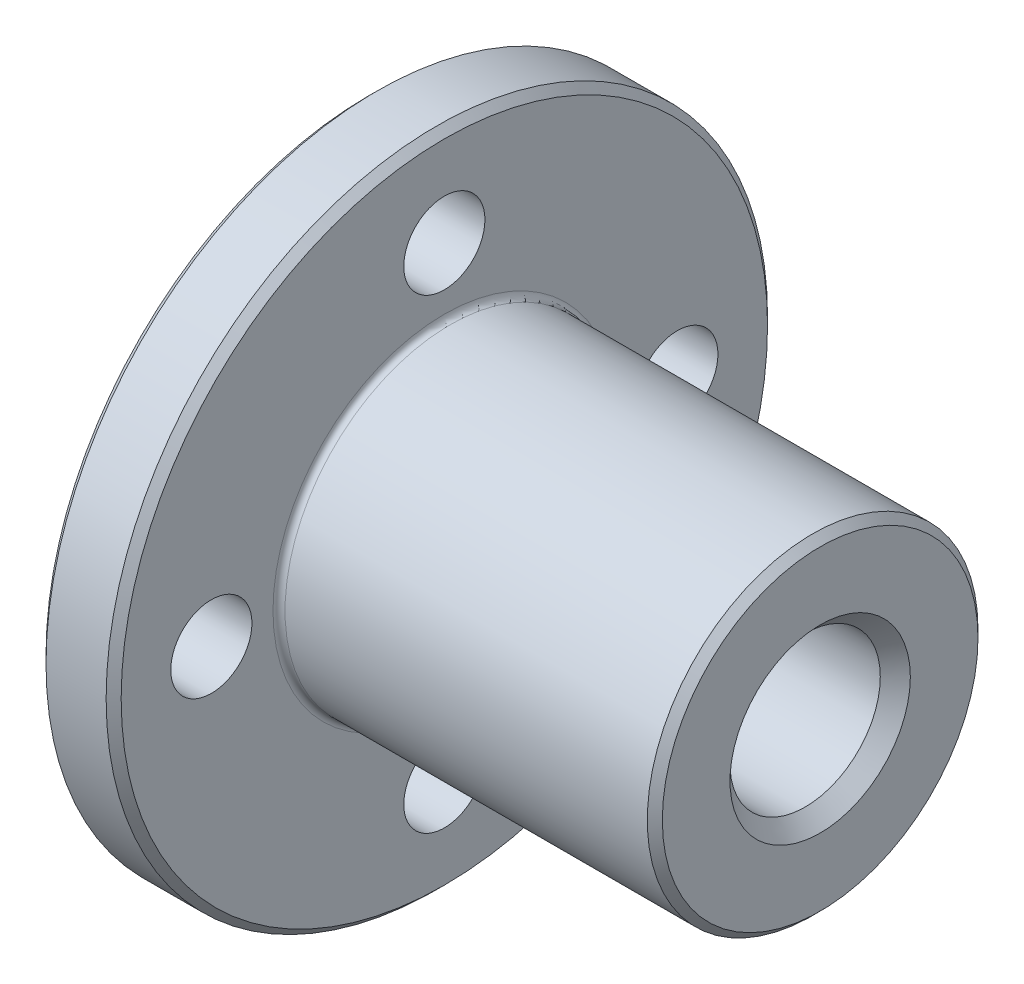
ISO-10303-21;
HEADER;
FILE_DESCRIPTION(('STEP AP214'),'2;1');
FILE_NAME('part.step','',(''),(''),'','','');
FILE_SCHEMA(('AUTOMOTIVE_DESIGN { 1 0 10303 214 1 1 1 1 }'));
ENDSEC;
DATA;
#1=APPLICATION_CONTEXT('core data for automotive mechanical design processes');
#2=APPLICATION_PROTOCOL_DEFINITION('international standard','automotive_design',2000,#1);
#3=PRODUCT_CONTEXT('',#1,'mechanical');
#4=PRODUCT('Part','Part','',(#3));
#5=PRODUCT_RELATED_PRODUCT_CATEGORY('part','',(#4));
#6=PRODUCT_DEFINITION_FORMATION('','',#4);
#7=PRODUCT_DEFINITION_CONTEXT('part definition',#1,'design');
#8=PRODUCT_DEFINITION('design','',#6,#7);
#9=PRODUCT_DEFINITION_SHAPE('','',#8);
#10=(LENGTH_UNIT() NAMED_UNIT(*) SI_UNIT(.MILLI.,.METRE.));
#11=(NAMED_UNIT(*) PLANE_ANGLE_UNIT() SI_UNIT($,.RADIAN.));
#12=(NAMED_UNIT(*) SI_UNIT($,.STERADIAN.) SOLID_ANGLE_UNIT());
#13=UNCERTAINTY_MEASURE_WITH_UNIT(LENGTH_MEASURE(1.E-05),#10,'distance_accuracy_value','');
#14=(GEOMETRIC_REPRESENTATION_CONTEXT(3) GLOBAL_UNCERTAINTY_ASSIGNED_CONTEXT((#13)) GLOBAL_UNIT_ASSIGNED_CONTEXT((#10,
#11,#12)) REPRESENTATION_CONTEXT('',''));
#15=CARTESIAN_POINT('',(0.,0.,0.));
#16=DIRECTION('',(0.,0.,1.));
#17=DIRECTION('',(1.,0.,0.));
#18=AXIS2_PLACEMENT_3D('',#15,#16,#17);
#19=CARTESIAN_POINT('',(5.,0.,0.));
#20=DIRECTION('',(-1.,0.,0.));
#21=DIRECTION('',(0.,0.,1.));
#22=AXIS2_PLACEMENT_3D('',#19,#20,#21);
#23=CYLINDRICAL_SURFACE('',#22,22.);
#24=CARTESIAN_POINT('',(0.500000000000025,0.,0.));
#25=DIRECTION('',(-1.,0.,0.));
#26=DIRECTION('',(0.,0.,1.));
#27=AXIS2_PLACEMENT_3D('',#24,#25,#26);
#28=CIRCLE('',#27,22.);
#29=CARTESIAN_POINT('',(0.500000000000025,0.,22.));
#30=VERTEX_POINT('',#29);
#31=EDGE_CURVE('E66',#30,#30,#28,.F.);
#32=ORIENTED_EDGE('',*,*,#31,.T.);
#33=EDGE_LOOP('',(#32));
#34=FACE_BOUND('',#33,.T.);
#35=CARTESIAN_POINT('',(4.49999999999999,0.,0.));
#36=DIRECTION('',(1.,0.,0.));
#37=DIRECTION('',(0.,0.,-1.));
#38=AXIS2_PLACEMENT_3D('',#35,#36,#37);
#39=CIRCLE('',#38,22.);
#40=CARTESIAN_POINT('',(4.49999999999999,0.,-22.));
#41=VERTEX_POINT('',#40);
#42=EDGE_CURVE('E69',#41,#41,#39,.F.);
#43=ORIENTED_EDGE('',*,*,#42,.T.);
#44=EDGE_LOOP('',(#43));
#45=FACE_BOUND('',#44,.T.);
#46=ADVANCED_FACE('F31',(#34,#45),#23,.T.);
#47=CARTESIAN_POINT('',(5.,22.,0.));
#48=DIRECTION('',(1.,0.,0.));
#49=DIRECTION('',(0.,0.,-1.));
#50=AXIS2_PLACEMENT_3D('',#47,#48,#49);
#51=PLANE('',#50);
#52=CARTESIAN_POINT('',(5.,0.,0.));
#53=DIRECTION('',(1.,0.,0.));
#54=DIRECTION('',(0.,0.,-1.));
#55=AXIS2_PLACEMENT_3D('',#52,#53,#54);
#56=CIRCLE('',#55,11.4);
#57=CARTESIAN_POINT('',(5.,0.,-11.4));
#58=VERTEX_POINT('',#57);
#59=EDGE_CURVE('E10',#58,#58,#56,.F.);
#60=ORIENTED_EDGE('',*,*,#59,.T.);
#61=EDGE_LOOP('',(#60));
#62=FACE_BOUND('',#61,.T.);
#63=CARTESIAN_POINT('',(5.,0.,0.));
#64=DIRECTION('',(1.,0.,0.));
#65=DIRECTION('',(0.,0.,-1.));
#66=AXIS2_PLACEMENT_3D('',#63,#64,#65);
#67=CIRCLE('',#66,21.5);
#68=CARTESIAN_POINT('',(5.,0.,-21.5));
#69=VERTEX_POINT('',#68);
#70=EDGE_CURVE('E57',#69,#69,#67,.T.);
#71=ORIENTED_EDGE('',*,*,#70,.T.);
#72=EDGE_LOOP('',(#71));
#73=FACE_BOUND('',#72,.T.);
#74=CARTESIAN_POINT('',(5.,-15.5,0.));
#75=DIRECTION('',(1.,0.,0.));
#76=DIRECTION('',(0.,0.,-1.));
#77=AXIS2_PLACEMENT_3D('',#74,#75,#76);
#78=CIRCLE('',#77,2.69999999999999);
#79=CARTESIAN_POINT('',(5.,-15.5,-2.69999999999999));
#80=VERTEX_POINT('',#79);
#81=EDGE_CURVE('E96',#80,#80,#78,.T.);
#82=ORIENTED_EDGE('',*,*,#81,.F.);
#83=EDGE_LOOP('',(#82));
#84=FACE_BOUND('',#83,.T.);
#85=CARTESIAN_POINT('',(5.,0.,-15.5));
#86=DIRECTION('',(1.,0.,0.));
#87=DIRECTION('',(0.,0.,-1.));
#88=AXIS2_PLACEMENT_3D('',#85,#86,#87);
#89=CIRCLE('',#88,2.69999999999999);
#90=CARTESIAN_POINT('',(5.,0.,-18.2));
#91=VERTEX_POINT('',#90);
#92=EDGE_CURVE('E90',#91,#91,#89,.T.);
#93=ORIENTED_EDGE('',*,*,#92,.F.);
#94=EDGE_LOOP('',(#93));
#95=FACE_BOUND('',#94,.T.);
#96=CARTESIAN_POINT('',(5.,0.,15.5));
#97=DIRECTION('',(1.,0.,0.));
#98=DIRECTION('',(0.,0.,-1.));
#99=AXIS2_PLACEMENT_3D('',#96,#97,#98);
#100=CIRCLE('',#99,2.69999999999999);
#101=CARTESIAN_POINT('',(5.,0.,12.8));
#102=VERTEX_POINT('',#101);
#103=EDGE_CURVE('E84',#102,#102,#100,.T.);
#104=ORIENTED_EDGE('',*,*,#103,.F.);
#105=EDGE_LOOP('',(#104));
#106=FACE_BOUND('',#105,.T.);
#107=CARTESIAN_POINT('',(5.,15.5,0.));
#108=DIRECTION('',(1.,0.,0.));
#109=DIRECTION('',(0.,0.,-1.));
#110=AXIS2_PLACEMENT_3D('',#107,#108,#109);
#111=CIRCLE('',#110,2.69999999999999);
#112=CARTESIAN_POINT('',(5.,15.5,-2.69999999999999));
#113=VERTEX_POINT('',#112);
#114=EDGE_CURVE('E78',#113,#113,#111,.T.);
#115=ORIENTED_EDGE('',*,*,#114,.F.);
#116=EDGE_LOOP('',(#115));
#117=FACE_BOUND('',#116,.T.);
#118=ADVANCED_FACE('F102',(#62,#73,#84,#95,#106,#117),#51,.T.);
#119=CARTESIAN_POINT('',(0.,0.,0.));
#120=DIRECTION('',(-1.,0.,0.));
#121=DIRECTION('',(0.,0.,1.));
#122=AXIS2_PLACEMENT_3D('',#119,#120,#121);
#123=PLANE('',#122);
#124=CARTESIAN_POINT('',(0.,0.,0.));
#125=DIRECTION('',(-1.,0.,0.));
#126=DIRECTION('',(0.,0.,1.));
#127=AXIS2_PLACEMENT_3D('',#124,#125,#126);
#128=CIRCLE('',#127,5.99999999999997);
#129=CARTESIAN_POINT('',(0.,0.,5.99999999999997));
#130=VERTEX_POINT('',#129);
#131=EDGE_CURVE('E54',#130,#130,#128,.F.);
#132=ORIENTED_EDGE('',*,*,#131,.T.);
#133=EDGE_LOOP('',(#132));
#134=FACE_BOUND('',#133,.T.);
#135=CARTESIAN_POINT('',(0.,0.,0.));
#136=DIRECTION('',(-1.,0.,0.));
#137=DIRECTION('',(0.,0.,1.));
#138=AXIS2_PLACEMENT_3D('',#135,#136,#137);
#139=CIRCLE('',#138,21.5);
#140=CARTESIAN_POINT('',(0.,0.,21.5));
#141=VERTEX_POINT('',#140);
#142=EDGE_CURVE('E72',#141,#141,#139,.T.);
#143=ORIENTED_EDGE('',*,*,#142,.T.);
#144=EDGE_LOOP('',(#143));
#145=FACE_BOUND('',#144,.T.);
#146=CARTESIAN_POINT('',(0.,-15.5,0.));
#147=DIRECTION('',(1.,0.,0.));
#148=DIRECTION('',(0.,0.,-1.));
#149=AXIS2_PLACEMENT_3D('',#146,#147,#148);
#150=CIRCLE('',#149,2.69999999999999);
#151=CARTESIAN_POINT('',(0.,-15.5,-2.69999999999999));
#152=VERTEX_POINT('',#151);
#153=EDGE_CURVE('E93',#152,#152,#150,.T.);
#154=ORIENTED_EDGE('',*,*,#153,.T.);
#155=EDGE_LOOP('',(#154));
#156=FACE_BOUND('',#155,.T.);
#157=CARTESIAN_POINT('',(0.,0.,-15.5));
#158=DIRECTION('',(1.,0.,0.));
#159=DIRECTION('',(0.,0.,-1.));
#160=AXIS2_PLACEMENT_3D('',#157,#158,#159);
#161=CIRCLE('',#160,2.69999999999999);
#162=CARTESIAN_POINT('',(0.,0.,-18.2));
#163=VERTEX_POINT('',#162);
#164=EDGE_CURVE('E87',#163,#163,#161,.T.);
#165=ORIENTED_EDGE('',*,*,#164,.T.);
#166=EDGE_LOOP('',(#165));
#167=FACE_BOUND('',#166,.T.);
#168=CARTESIAN_POINT('',(0.,0.,15.5));
#169=DIRECTION('',(1.,0.,0.));
#170=DIRECTION('',(0.,0.,-1.));
#171=AXIS2_PLACEMENT_3D('',#168,#169,#170);
#172=CIRCLE('',#171,2.69999999999999);
#173=CARTESIAN_POINT('',(0.,0.,12.8));
#174=VERTEX_POINT('',#173);
#175=EDGE_CURVE('E81',#174,#174,#172,.T.);
#176=ORIENTED_EDGE('',*,*,#175,.T.);
#177=EDGE_LOOP('',(#176));
#178=FACE_BOUND('',#177,.T.);
#179=CARTESIAN_POINT('',(0.,15.5,0.));
#180=DIRECTION('',(1.,0.,0.));
#181=DIRECTION('',(0.,0.,-1.));
#182=AXIS2_PLACEMENT_3D('',#179,#180,#181);
#183=CIRCLE('',#182,2.69999999999999);
#184=CARTESIAN_POINT('',(0.,15.5,-2.69999999999999));
#185=VERTEX_POINT('',#184);
#186=EDGE_CURVE('E75',#185,#185,#183,.T.);
#187=ORIENTED_EDGE('',*,*,#186,.T.);
#188=EDGE_LOOP('',(#187));
#189=FACE_BOUND('',#188,.T.);
#190=ADVANCED_FACE('F105',(#134,#145,#156,#167,#178,#189),#123,.T.);
#191=CARTESIAN_POINT('',(30.,0.,0.));
#192=DIRECTION('',(-1.,0.,0.));
#193=DIRECTION('',(0.,0.,1.));
#194=AXIS2_PLACEMENT_3D('',#191,#192,#193);
#195=CYLINDRICAL_SURFACE('',#194,11.);
#196=CARTESIAN_POINT('',(5.4,0.,0.));
#197=DIRECTION('',(1.,0.,0.));
#198=DIRECTION('',(0.,0.,-1.));
#199=AXIS2_PLACEMENT_3D('',#196,#197,#198);
#200=CIRCLE('',#199,11.);
#201=CARTESIAN_POINT('',(5.4,0.,-11.));
#202=VERTEX_POINT('',#201);
#203=EDGE_CURVE('E38',#202,#202,#200,.T.);
#204=ORIENTED_EDGE('',*,*,#203,.T.);
#205=EDGE_LOOP('',(#204));
#206=FACE_BOUND('',#205,.T.);
#207=CARTESIAN_POINT('',(29.5,0.,0.));
#208=DIRECTION('',(1.,0.,0.));
#209=DIRECTION('',(0.,0.,-1.));
#210=AXIS2_PLACEMENT_3D('',#207,#208,#209);
#211=CIRCLE('',#210,11.);
#212=CARTESIAN_POINT('',(29.5,0.,-11.));
#213=VERTEX_POINT('',#212);
#214=EDGE_CURVE('E60',#213,#213,#211,.F.);
#215=ORIENTED_EDGE('',*,*,#214,.T.);
#216=EDGE_LOOP('',(#215));
#217=FACE_BOUND('',#216,.T.);
#218=ADVANCED_FACE('F126',(#206,#217),#195,.T.);
#219=CARTESIAN_POINT('',(30.,0.,0.));
#220=DIRECTION('',(1.,0.,0.));
#221=DIRECTION('',(0.,0.,-1.));
#222=AXIS2_PLACEMENT_3D('',#219,#220,#221);
#223=PLANE('',#222);
#224=CARTESIAN_POINT('',(30.,0.,0.));
#225=DIRECTION('',(1.,0.,0.));
#226=DIRECTION('',(0.,0.,-1.));
#227=AXIS2_PLACEMENT_3D('',#224,#225,#226);
#228=CIRCLE('',#227,5.99999999999995);
#229=CARTESIAN_POINT('',(30.,0.,-5.99999999999995));
#230=VERTEX_POINT('',#229);
#231=EDGE_CURVE('E42',#230,#230,#228,.F.);
#232=ORIENTED_EDGE('',*,*,#231,.T.);
#233=EDGE_LOOP('',(#232));
#234=FACE_BOUND('',#233,.T.);
#235=CARTESIAN_POINT('',(30.,0.,0.));
#236=DIRECTION('',(1.,0.,0.));
#237=DIRECTION('',(0.,0.,-1.));
#238=AXIS2_PLACEMENT_3D('',#235,#236,#237);
#239=CIRCLE('',#238,10.5);
#240=CARTESIAN_POINT('',(30.,0.,-10.5));
#241=VERTEX_POINT('',#240);
#242=EDGE_CURVE('E63',#241,#241,#239,.T.);
#243=ORIENTED_EDGE('',*,*,#242,.T.);
#244=EDGE_LOOP('',(#243));
#245=FACE_BOUND('',#244,.T.);
#246=ADVANCED_FACE('F116',(#234,#245),#223,.T.);
#247=CARTESIAN_POINT('',(5.,15.5,0.));
#248=DIRECTION('',(1.,0.,0.));
#249=DIRECTION('',(0.,0.,-1.));
#250=AXIS2_PLACEMENT_3D('',#247,#248,#249);
#251=CYLINDRICAL_SURFACE('',#250,2.69999999999999);
#252=ORIENTED_EDGE('',*,*,#186,.F.);
#253=EDGE_LOOP('',(#252));
#254=FACE_BOUND('',#253,.T.);
#255=ORIENTED_EDGE('',*,*,#114,.T.);
#256=EDGE_LOOP('',(#255));
#257=FACE_BOUND('',#256,.T.);
#258=ADVANCED_FACE('F113',(#254,#257),#251,.F.);
#259=CARTESIAN_POINT('',(5.,0.,15.5));
#260=DIRECTION('',(1.,0.,0.));
#261=DIRECTION('',(0.,0.,-1.));
#262=AXIS2_PLACEMENT_3D('',#259,#260,#261);
#263=CYLINDRICAL_SURFACE('',#262,2.69999999999999);
#264=ORIENTED_EDGE('',*,*,#175,.F.);
#265=EDGE_LOOP('',(#264));
#266=FACE_BOUND('',#265,.T.);
#267=ORIENTED_EDGE('',*,*,#103,.T.);
#268=EDGE_LOOP('',(#267));
#269=FACE_BOUND('',#268,.T.);
#270=ADVANCED_FACE('F115',(#266,#269),#263,.F.);
#271=CARTESIAN_POINT('',(5.,0.,-15.5));
#272=DIRECTION('',(1.,0.,0.));
#273=DIRECTION('',(0.,0.,-1.));
#274=AXIS2_PLACEMENT_3D('',#271,#272,#273);
#275=CYLINDRICAL_SURFACE('',#274,2.69999999999999);
#276=ORIENTED_EDGE('',*,*,#164,.F.);
#277=EDGE_LOOP('',(#276));
#278=FACE_BOUND('',#277,.T.);
#279=ORIENTED_EDGE('',*,*,#92,.T.);
#280=EDGE_LOOP('',(#279));
#281=FACE_BOUND('',#280,.T.);
#282=ADVANCED_FACE('F123',(#278,#281),#275,.F.);
#283=CARTESIAN_POINT('',(5.,-15.5,0.));
#284=DIRECTION('',(1.,0.,0.));
#285=DIRECTION('',(0.,0.,-1.));
#286=AXIS2_PLACEMENT_3D('',#283,#284,#285);
#287=CYLINDRICAL_SURFACE('',#286,2.69999999999999);
#288=ORIENTED_EDGE('',*,*,#153,.F.);
#289=EDGE_LOOP('',(#288));
#290=FACE_BOUND('',#289,.T.);
#291=ORIENTED_EDGE('',*,*,#81,.T.);
#292=EDGE_LOOP('',(#291));
#293=FACE_BOUND('',#292,.T.);
#294=ADVANCED_FACE('F100',(#290,#293),#287,.F.);
#295=CARTESIAN_POINT('',(30.,0.,0.));
#296=DIRECTION('',(1.,0.,0.));
#297=DIRECTION('',(0.,0.,-1.));
#298=AXIS2_PLACEMENT_3D('',#295,#296,#297);
#299=CYLINDRICAL_SURFACE('',#298,4.99999999999999);
#300=CARTESIAN_POINT('',(0.99999999999999,0.,0.));
#301=DIRECTION('',(-1.,0.,0.));
#302=DIRECTION('',(0.,0.,1.));
#303=AXIS2_PLACEMENT_3D('',#300,#301,#302);
#304=CIRCLE('',#303,4.99999999999999);
#305=CARTESIAN_POINT('',(0.99999999999999,0.,4.99999999999999));
#306=VERTEX_POINT('',#305);
#307=EDGE_CURVE('E46',#306,#306,#304,.T.);
#308=ORIENTED_EDGE('',*,*,#307,.T.);
#309=EDGE_LOOP('',(#308));
#310=FACE_BOUND('',#309,.T.);
#311=CARTESIAN_POINT('',(29.,0.,0.));
#312=DIRECTION('',(1.,0.,0.));
#313=DIRECTION('',(0.,0.,-1.));
#314=AXIS2_PLACEMENT_3D('',#311,#312,#313);
#315=CIRCLE('',#314,4.99999999999999);
#316=CARTESIAN_POINT('',(29.,0.,-4.99999999999999));
#317=VERTEX_POINT('',#316);
#318=EDGE_CURVE('E51',#317,#317,#315,.T.);
#319=ORIENTED_EDGE('',*,*,#318,.T.);
#320=EDGE_LOOP('',(#319));
#321=FACE_BOUND('',#320,.T.);
#322=ADVANCED_FACE('F142',(#310,#321),#299,.F.);
#323=CARTESIAN_POINT('',(0.,0.,0.));
#324=DIRECTION('',(1.,0.,0.));
#325=DIRECTION('',(0.,0.,-1.));
#326=AXIS2_PLACEMENT_3D('',#323,#324,#325);
#327=CONICAL_SURFACE('',#326,21.5,0.785398163397445);
#328=ORIENTED_EDGE('',*,*,#31,.F.);
#329=EDGE_LOOP('',(#328));
#330=FACE_BOUND('',#329,.T.);
#331=ORIENTED_EDGE('',*,*,#142,.F.);
#332=EDGE_LOOP('',(#331));
#333=FACE_BOUND('',#332,.T.);
#334=ADVANCED_FACE('F138',(#330,#333),#327,.T.);
#335=CARTESIAN_POINT('',(30.,0.,0.));
#336=DIRECTION('',(-1.,0.,0.));
#337=DIRECTION('',(0.,0.,1.));
#338=AXIS2_PLACEMENT_3D('',#335,#336,#337);
#339=CONICAL_SURFACE('',#338,10.5,0.785398163397443);
#340=ORIENTED_EDGE('',*,*,#214,.F.);
#341=EDGE_LOOP('',(#340));
#342=FACE_BOUND('',#341,.T.);
#343=ORIENTED_EDGE('',*,*,#242,.F.);
#344=EDGE_LOOP('',(#343));
#345=FACE_BOUND('',#344,.T.);
#346=ADVANCED_FACE('F141',(#342,#345),#339,.T.);
#347=CARTESIAN_POINT('',(4.49999999999999,0.,0.));
#348=DIRECTION('',(-1.,0.,0.));
#349=DIRECTION('',(0.,0.,1.));
#350=AXIS2_PLACEMENT_3D('',#347,#348,#349);
#351=CONICAL_SURFACE('',#350,22.,0.785398163397455);
#352=ORIENTED_EDGE('',*,*,#70,.F.);
#353=EDGE_LOOP('',(#352));
#354=FACE_BOUND('',#353,.T.);
#355=ORIENTED_EDGE('',*,*,#42,.F.);
#356=EDGE_LOOP('',(#355));
#357=FACE_BOUND('',#356,.T.);
#358=ADVANCED_FACE('F146',(#354,#357),#351,.T.);
#359=CARTESIAN_POINT('',(0.,0.,0.));
#360=DIRECTION('',(-1.,0.,0.));
#361=DIRECTION('',(0.,0.,1.));
#362=AXIS2_PLACEMENT_3D('',#359,#360,#361);
#363=CONICAL_SURFACE('',#362,5.99999999999997,0.785398163397445);
#364=ORIENTED_EDGE('',*,*,#307,.F.);
#365=EDGE_LOOP('',(#364));
#366=FACE_BOUND('',#365,.T.);
#367=ORIENTED_EDGE('',*,*,#131,.F.);
#368=EDGE_LOOP('',(#367));
#369=FACE_BOUND('',#368,.T.);
#370=ADVANCED_FACE('F150',(#366,#369),#363,.F.);
#371=CARTESIAN_POINT('',(29.,0.,0.));
#372=DIRECTION('',(1.,0.,0.));
#373=DIRECTION('',(0.,0.,-1.));
#374=AXIS2_PLACEMENT_3D('',#371,#372,#373);
#375=CONICAL_SURFACE('',#374,4.99999999999999,0.78539816339745);
#376=ORIENTED_EDGE('',*,*,#231,.F.);
#377=EDGE_LOOP('',(#376));
#378=FACE_BOUND('',#377,.T.);
#379=ORIENTED_EDGE('',*,*,#318,.F.);
#380=EDGE_LOOP('',(#379));
#381=FACE_BOUND('',#380,.T.);
#382=ADVANCED_FACE('F153',(#378,#381),#375,.F.);
#383=CARTESIAN_POINT('',(5.4,0.,0.));
#384=DIRECTION('',(1.,0.,0.));
#385=DIRECTION('',(0.,0.,-1.));
#386=AXIS2_PLACEMENT_3D('',#383,#384,#385);
#387=TOROIDAL_SURFACE('',#386,11.4,0.4);
#388=ORIENTED_EDGE('',*,*,#59,.F.);
#389=EDGE_LOOP('',(#388));
#390=FACE_BOUND('',#389,.T.);
#391=ORIENTED_EDGE('',*,*,#203,.F.);
#392=EDGE_LOOP('',(#391));
#393=FACE_BOUND('',#392,.T.);
#394=ADVANCED_FACE('F33',(#390,#393),#387,.F.);
#395=CLOSED_SHELL('',(#46,#118,#190,#218,#246,#258,#270,#282,#294,#322,#334,#346,#358,#370,#382,#394));
#396=MANIFOLD_SOLID_BREP('B2',#395);
#397=ADVANCED_BREP_SHAPE_REPRESENTATION('',(#18,#396),#14);
#398=SHAPE_DEFINITION_REPRESENTATION(#9,#397);
ENDSEC;
END-ISO-10303-21;
